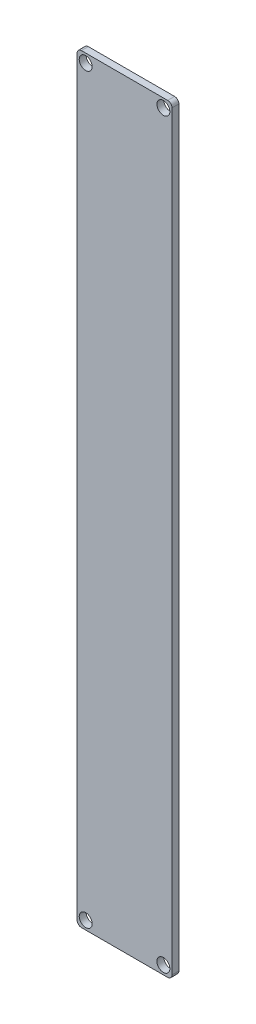
ISO-10303-21;
HEADER;
FILE_DESCRIPTION(('STEP AP214'),'2;1');
FILE_NAME('part.step','',(''),(''),'','','');
FILE_SCHEMA(('AUTOMOTIVE_DESIGN { 1 0 10303 214 1 1 1 1 }'));
ENDSEC;
DATA;
#1=APPLICATION_CONTEXT('core data for automotive mechanical design processes');
#2=APPLICATION_PROTOCOL_DEFINITION('international standard','automotive_design',2000,#1);
#3=PRODUCT_CONTEXT('',#1,'mechanical');
#4=PRODUCT('Part','Part','',(#3));
#5=PRODUCT_RELATED_PRODUCT_CATEGORY('part','',(#4));
#6=PRODUCT_DEFINITION_FORMATION('','',#4);
#7=PRODUCT_DEFINITION_CONTEXT('part definition',#1,'design');
#8=PRODUCT_DEFINITION('design','',#6,#7);
#9=PRODUCT_DEFINITION_SHAPE('','',#8);
#10=(LENGTH_UNIT() NAMED_UNIT(*) SI_UNIT(.MILLI.,.METRE.));
#11=(NAMED_UNIT(*) PLANE_ANGLE_UNIT() SI_UNIT($,.RADIAN.));
#12=(NAMED_UNIT(*) SI_UNIT($,.STERADIAN.) SOLID_ANGLE_UNIT());
#13=UNCERTAINTY_MEASURE_WITH_UNIT(LENGTH_MEASURE(1.E-05),#10,'distance_accuracy_value','');
#14=(GEOMETRIC_REPRESENTATION_CONTEXT(3) GLOBAL_UNCERTAINTY_ASSIGNED_CONTEXT((#13)) GLOBAL_UNIT_ASSIGNED_CONTEXT((#10,
#11,#12)) REPRESENTATION_CONTEXT('',''));
#15=CARTESIAN_POINT('',(0.,0.,0.));
#16=DIRECTION('',(0.,0.,1.));
#17=DIRECTION('',(1.,0.,0.));
#18=AXIS2_PLACEMENT_3D('',#15,#16,#17);
#19=CARTESIAN_POINT('',(-35.5384615384615,79.3692307692308,1.6));
#20=DIRECTION('',(1.,0.,0.));
#21=DIRECTION('',(0.,1.,0.));
#22=AXIS2_PLACEMENT_3D('',#19,#20,#21);
#23=PLANE('',#22);
#24=DIRECTION('',(0.,-1.,0.));
#25=VECTOR('',#24,1.);
#26=CARTESIAN_POINT('',(-35.5384615384615,79.3692307692308,1.6));
#27=LINE('',#26,#25);
#28=CARTESIAN_POINT('',(-35.5384615384615,78.3692307692308,1.6));
#29=VERTEX_POINT('',#28);
#30=CARTESIAN_POINT('',(-35.5384615384615,-95.6307692307692,1.6));
#31=VERTEX_POINT('',#30);
#32=EDGE_CURVE('E119',#29,#31,#27,.T.);
#33=ORIENTED_EDGE('',*,*,#32,.F.);
#34=DIRECTION('',(0.,0.,-1.));
#35=VECTOR('',#34,1.);
#36=CARTESIAN_POINT('',(-35.5384615384615,78.3692307692308,1.6));
#37=LINE('',#36,#35);
#38=CARTESIAN_POINT('',(-35.5384615384615,78.3692307692308,0.));
#39=VERTEX_POINT('',#38);
#40=EDGE_CURVE('E104',#29,#39,#37,.T.);
#41=ORIENTED_EDGE('',*,*,#40,.T.);
#42=DIRECTION('',(0.,-1.,0.));
#43=VECTOR('',#42,1.);
#44=CARTESIAN_POINT('',(-35.5384615384615,79.3692307692308,0.));
#45=LINE('',#44,#43);
#46=CARTESIAN_POINT('',(-35.5384615384615,-95.6307692307692,0.));
#47=VERTEX_POINT('',#46);
#48=EDGE_CURVE('E116',#39,#47,#45,.T.);
#49=ORIENTED_EDGE('',*,*,#48,.T.);
#50=DIRECTION('',(0.,0.,-1.));
#51=VECTOR('',#50,1.);
#52=CARTESIAN_POINT('',(-35.5384615384615,-95.6307692307692,1.6));
#53=LINE('',#52,#51);
#54=EDGE_CURVE('E121',#47,#31,#53,.F.);
#55=ORIENTED_EDGE('',*,*,#54,.T.);
#56=EDGE_LOOP('',(#33,#41,#49,#55));
#57=FACE_BOUND('',#56,.T.);
#58=ADVANCED_FACE('F34',(#57),#23,.F.);
#59=CARTESIAN_POINT('',(-35.5384615384615,-96.6307692307692,1.6));
#60=DIRECTION('',(0.,1.,0.));
#61=DIRECTION('',(0.,0.,1.));
#62=AXIS2_PLACEMENT_3D('',#59,#60,#61);
#63=PLANE('',#62);
#64=DIRECTION('',(1.,0.,0.));
#65=VECTOR('',#64,1.);
#66=CARTESIAN_POINT('',(-35.5384615384615,-96.6307692307692,0.));
#67=LINE('',#66,#65);
#68=CARTESIAN_POINT('',(-34.5384615384615,-96.6307692307692,0.));
#69=VERTEX_POINT('',#68);
#70=CARTESIAN_POINT('',(-14.5384615384615,-96.6307692307692,0.));
#71=VERTEX_POINT('',#70);
#72=EDGE_CURVE('E125',#69,#71,#67,.T.);
#73=ORIENTED_EDGE('',*,*,#72,.T.);
#74=DIRECTION('',(0.,0.,-1.));
#75=VECTOR('',#74,1.);
#76=CARTESIAN_POINT('',(-14.5384615384615,-96.6307692307692,1.6));
#77=LINE('',#76,#75);
#78=CARTESIAN_POINT('',(-14.5384615384615,-96.6307692307692,1.6));
#79=VERTEX_POINT('',#78);
#80=EDGE_CURVE('E11',#71,#79,#77,.F.);
#81=ORIENTED_EDGE('',*,*,#80,.T.);
#82=DIRECTION('',(1.,0.,0.));
#83=VECTOR('',#82,1.);
#84=CARTESIAN_POINT('',(-35.5384615384615,-96.6307692307692,1.6));
#85=LINE('',#84,#83);
#86=CARTESIAN_POINT('',(-34.5384615384615,-96.6307692307692,1.6));
#87=VERTEX_POINT('',#86);
#88=EDGE_CURVE('E165',#87,#79,#85,.T.);
#89=ORIENTED_EDGE('',*,*,#88,.F.);
#90=DIRECTION('',(0.,0.,-1.));
#91=VECTOR('',#90,1.);
#92=CARTESIAN_POINT('',(-34.5384615384615,-96.6307692307692,1.6));
#93=LINE('',#92,#91);
#94=EDGE_CURVE('E42',#87,#69,#93,.T.);
#95=ORIENTED_EDGE('',*,*,#94,.T.);
#96=EDGE_LOOP('',(#73,#81,#89,#95));
#97=FACE_BOUND('',#96,.T.);
#98=ADVANCED_FACE('F163',(#97),#63,.F.);
#99=CARTESIAN_POINT('',(-13.5384615384615,79.3692307692308,1.6));
#100=DIRECTION('',(-1.,0.,0.));
#101=DIRECTION('',(0.,-1.,0.));
#102=AXIS2_PLACEMENT_3D('',#99,#100,#101);
#103=PLANE('',#102);
#104=DIRECTION('',(0.,1.,0.));
#105=VECTOR('',#104,1.);
#106=CARTESIAN_POINT('',(-13.5384615384615,79.3692307692308,0.));
#107=LINE('',#106,#105);
#108=CARTESIAN_POINT('',(-13.5384615384615,-95.6307692307692,0.));
#109=VERTEX_POINT('',#108);
#110=CARTESIAN_POINT('',(-13.5384615384615,78.3692307692308,0.));
#111=VERTEX_POINT('',#110);
#112=EDGE_CURVE('E129',#109,#111,#107,.T.);
#113=ORIENTED_EDGE('',*,*,#112,.T.);
#114=DIRECTION('',(0.,0.,-1.));
#115=VECTOR('',#114,1.);
#116=CARTESIAN_POINT('',(-13.5384615384615,78.3692307692308,1.6));
#117=LINE('',#116,#115);
#118=CARTESIAN_POINT('',(-13.5384615384615,78.3692307692308,1.6));
#119=VERTEX_POINT('',#118);
#120=EDGE_CURVE('E49',#111,#119,#117,.F.);
#121=ORIENTED_EDGE('',*,*,#120,.T.);
#122=DIRECTION('',(0.,1.,0.));
#123=VECTOR('',#122,1.);
#124=CARTESIAN_POINT('',(-13.5384615384615,79.3692307692308,1.6));
#125=LINE('',#124,#123);
#126=CARTESIAN_POINT('',(-13.5384615384615,-95.6307692307692,1.6));
#127=VERTEX_POINT('',#126);
#128=EDGE_CURVE('E173',#127,#119,#125,.T.);
#129=ORIENTED_EDGE('',*,*,#128,.F.);
#130=DIRECTION('',(0.,0.,-1.));
#131=VECTOR('',#130,1.);
#132=CARTESIAN_POINT('',(-13.5384615384615,-95.6307692307692,1.6));
#133=LINE('',#132,#131);
#134=EDGE_CURVE('E156',#127,#109,#133,.T.);
#135=ORIENTED_EDGE('',*,*,#134,.T.);
#136=EDGE_LOOP('',(#113,#121,#129,#135));
#137=FACE_BOUND('',#136,.T.);
#138=ADVANCED_FACE('F172',(#137),#103,.F.);
#139=CARTESIAN_POINT('',(-35.5384615384615,79.3692307692308,1.6));
#140=DIRECTION('',(0.,-1.,0.));
#141=DIRECTION('',(0.,0.,-1.));
#142=AXIS2_PLACEMENT_3D('',#139,#140,#141);
#143=PLANE('',#142);
#144=DIRECTION('',(-1.,0.,0.));
#145=VECTOR('',#144,1.);
#146=CARTESIAN_POINT('',(-35.5384615384615,79.3692307692308,0.));
#147=LINE('',#146,#145);
#148=CARTESIAN_POINT('',(-14.5384615384615,79.3692307692308,0.));
#149=VERTEX_POINT('',#148);
#150=CARTESIAN_POINT('',(-34.5384615384615,79.3692307692308,0.));
#151=VERTEX_POINT('',#150);
#152=EDGE_CURVE('E139',#149,#151,#147,.T.);
#153=ORIENTED_EDGE('',*,*,#152,.T.);
#154=DIRECTION('',(0.,0.,-1.));
#155=VECTOR('',#154,1.);
#156=CARTESIAN_POINT('',(-34.5384615384615,79.3692307692308,1.6));
#157=LINE('',#156,#155);
#158=CARTESIAN_POINT('',(-34.5384615384615,79.3692307692308,1.6));
#159=VERTEX_POINT('',#158);
#160=EDGE_CURVE('E105',#151,#159,#157,.F.);
#161=ORIENTED_EDGE('',*,*,#160,.T.);
#162=DIRECTION('',(-1.,0.,0.));
#163=VECTOR('',#162,1.);
#164=CARTESIAN_POINT('',(-35.5384615384615,79.3692307692308,1.6));
#165=LINE('',#164,#163);
#166=CARTESIAN_POINT('',(-14.5384615384615,79.3692307692308,1.6));
#167=VERTEX_POINT('',#166);
#168=EDGE_CURVE('E135',#167,#159,#165,.T.);
#169=ORIENTED_EDGE('',*,*,#168,.F.);
#170=DIRECTION('',(0.,0.,-1.));
#171=VECTOR('',#170,1.);
#172=CARTESIAN_POINT('',(-14.5384615384615,79.3692307692308,1.6));
#173=LINE('',#172,#171);
#174=EDGE_CURVE('E110',#167,#149,#173,.T.);
#175=ORIENTED_EDGE('',*,*,#174,.T.);
#176=EDGE_LOOP('',(#153,#161,#169,#175));
#177=FACE_BOUND('',#176,.T.);
#178=ADVANCED_FACE('F213',(#177),#143,.F.);
#179=CARTESIAN_POINT('',(0.,0.,1.6));
#180=DIRECTION('',(0.,0.,1.));
#181=DIRECTION('',(1.,0.,0.));
#182=AXIS2_PLACEMENT_3D('',#179,#180,#181);
#183=PLANE('',#182);
#184=CARTESIAN_POINT('',(-15.5384615384615,77.3692307692308,1.6));
#185=DIRECTION('',(0.,0.,1.));
#186=DIRECTION('',(1.,0.,0.));
#187=AXIS2_PLACEMENT_3D('',#184,#185,#186);
#188=CIRCLE('',#187,1.5);
#189=CARTESIAN_POINT('',(-14.0384615384615,77.3692307692308,1.6));
#190=VERTEX_POINT('',#189);
#191=EDGE_CURVE('E189',#190,#190,#188,.T.);
#192=ORIENTED_EDGE('',*,*,#191,.F.);
#193=EDGE_LOOP('',(#192));
#194=FACE_BOUND('',#193,.T.);
#195=CARTESIAN_POINT('',(-33.5384615384615,-94.6307692307692,1.6));
#196=DIRECTION('',(0.,0.,1.));
#197=DIRECTION('',(1.,0.,0.));
#198=AXIS2_PLACEMENT_3D('',#195,#196,#197);
#199=CIRCLE('',#198,1.5);
#200=CARTESIAN_POINT('',(-32.0384615384615,-94.6307692307692,1.6));
#201=VERTEX_POINT('',#200);
#202=EDGE_CURVE('E182',#201,#201,#199,.T.);
#203=ORIENTED_EDGE('',*,*,#202,.F.);
#204=EDGE_LOOP('',(#203));
#205=FACE_BOUND('',#204,.T.);
#206=CARTESIAN_POINT('',(-15.5384615384615,-94.6307692307692,1.6));
#207=DIRECTION('',(0.,0.,1.));
#208=DIRECTION('',(1.,0.,0.));
#209=AXIS2_PLACEMENT_3D('',#206,#207,#208);
#210=CIRCLE('',#209,1.5);
#211=CARTESIAN_POINT('',(-14.0384615384615,-94.6307692307692,1.6));
#212=VERTEX_POINT('',#211);
#213=EDGE_CURVE('E194',#212,#212,#210,.T.);
#214=ORIENTED_EDGE('',*,*,#213,.F.);
#215=EDGE_LOOP('',(#214));
#216=FACE_BOUND('',#215,.T.);
#217=CARTESIAN_POINT('',(-33.5384615384615,77.3692307692308,1.6));
#218=DIRECTION('',(0.,0.,1.));
#219=DIRECTION('',(1.,0.,0.));
#220=AXIS2_PLACEMENT_3D('',#217,#218,#219);
#221=CIRCLE('',#220,1.5);
#222=CARTESIAN_POINT('',(-32.0384615384615,77.3692307692308,1.6));
#223=VERTEX_POINT('',#222);
#224=EDGE_CURVE('E132',#223,#223,#221,.T.);
#225=ORIENTED_EDGE('',*,*,#224,.F.);
#226=EDGE_LOOP('',(#225));
#227=FACE_BOUND('',#226,.T.);
#228=ORIENTED_EDGE('',*,*,#168,.T.);
#229=CARTESIAN_POINT('',(-34.5384615384615,78.3692307692308,1.6));
#230=DIRECTION('',(0.,0.,1.));
#231=DIRECTION('',(1.,0.,0.));
#232=AXIS2_PLACEMENT_3D('',#229,#230,#231);
#233=CIRCLE('',#232,1.);
#234=EDGE_CURVE('E154',#159,#29,#233,.T.);
#235=ORIENTED_EDGE('',*,*,#234,.T.);
#236=ORIENTED_EDGE('',*,*,#32,.T.);
#237=CARTESIAN_POINT('',(-34.5384615384615,-95.6307692307692,1.6));
#238=DIRECTION('',(0.,0.,1.));
#239=DIRECTION('',(1.,0.,0.));
#240=AXIS2_PLACEMENT_3D('',#237,#238,#239);
#241=CIRCLE('',#240,1.);
#242=EDGE_CURVE('E149',#31,#87,#241,.T.);
#243=ORIENTED_EDGE('',*,*,#242,.T.);
#244=ORIENTED_EDGE('',*,*,#88,.T.);
#245=CARTESIAN_POINT('',(-14.5384615384615,-95.6307692307692,1.6));
#246=DIRECTION('',(0.,0.,1.));
#247=DIRECTION('',(1.,0.,0.));
#248=AXIS2_PLACEMENT_3D('',#245,#246,#247);
#249=CIRCLE('',#248,1.);
#250=EDGE_CURVE('E56',#79,#127,#249,.T.);
#251=ORIENTED_EDGE('',*,*,#250,.T.);
#252=ORIENTED_EDGE('',*,*,#128,.T.);
#253=CARTESIAN_POINT('',(-14.5384615384615,78.3692307692308,1.6));
#254=DIRECTION('',(0.,0.,1.));
#255=DIRECTION('',(1.,0.,0.));
#256=AXIS2_PLACEMENT_3D('',#253,#254,#255);
#257=CIRCLE('',#256,1.);
#258=EDGE_CURVE('E152',#119,#167,#257,.T.);
#259=ORIENTED_EDGE('',*,*,#258,.T.);
#260=EDGE_LOOP('',(#228,#235,#236,#243,#244,#251,#252,#259));
#261=FACE_BOUND('',#260,.T.);
#262=ADVANCED_FACE('F210',(#194,#205,#216,#227,#261),#183,.T.);
#263=CARTESIAN_POINT('',(0.,0.,0.));
#264=DIRECTION('',(0.,0.,1.));
#265=DIRECTION('',(1.,0.,0.));
#266=AXIS2_PLACEMENT_3D('',#263,#264,#265);
#267=PLANE('',#266);
#268=CARTESIAN_POINT('',(-15.5384615384615,77.3692307692308,0.));
#269=DIRECTION('',(0.,0.,1.));
#270=DIRECTION('',(1.,0.,0.));
#271=AXIS2_PLACEMENT_3D('',#268,#269,#270);
#272=CIRCLE('',#271,1.5);
#273=CARTESIAN_POINT('',(-14.0384615384615,77.3692307692308,0.));
#274=VERTEX_POINT('',#273);
#275=EDGE_CURVE('E180',#274,#274,#272,.T.);
#276=ORIENTED_EDGE('',*,*,#275,.T.);
#277=EDGE_LOOP('',(#276));
#278=FACE_BOUND('',#277,.T.);
#279=CARTESIAN_POINT('',(-33.5384615384615,-94.6307692307692,0.));
#280=DIRECTION('',(0.,0.,1.));
#281=DIRECTION('',(1.,0.,0.));
#282=AXIS2_PLACEMENT_3D('',#279,#280,#281);
#283=CIRCLE('',#282,1.5);
#284=CARTESIAN_POINT('',(-32.0384615384615,-94.6307692307692,0.));
#285=VERTEX_POINT('',#284);
#286=EDGE_CURVE('E185',#285,#285,#283,.T.);
#287=ORIENTED_EDGE('',*,*,#286,.T.);
#288=EDGE_LOOP('',(#287));
#289=FACE_BOUND('',#288,.T.);
#290=CARTESIAN_POINT('',(-15.5384615384615,-94.6307692307692,0.));
#291=DIRECTION('',(0.,0.,1.));
#292=DIRECTION('',(1.,0.,0.));
#293=AXIS2_PLACEMENT_3D('',#290,#291,#292);
#294=CIRCLE('',#293,1.5);
#295=CARTESIAN_POINT('',(-14.0384615384615,-94.6307692307692,0.));
#296=VERTEX_POINT('',#295);
#297=EDGE_CURVE('E186',#296,#296,#294,.T.);
#298=ORIENTED_EDGE('',*,*,#297,.T.);
#299=EDGE_LOOP('',(#298));
#300=FACE_BOUND('',#299,.T.);
#301=CARTESIAN_POINT('',(-33.5384615384615,77.3692307692308,0.));
#302=DIRECTION('',(0.,0.,1.));
#303=DIRECTION('',(1.,0.,0.));
#304=AXIS2_PLACEMENT_3D('',#301,#302,#303);
#305=CIRCLE('',#304,1.5);
#306=CARTESIAN_POINT('',(-32.0384615384615,77.3692307692308,0.));
#307=VERTEX_POINT('',#306);
#308=EDGE_CURVE('E126',#307,#307,#305,.T.);
#309=ORIENTED_EDGE('',*,*,#308,.T.);
#310=EDGE_LOOP('',(#309));
#311=FACE_BOUND('',#310,.T.);
#312=ORIENTED_EDGE('',*,*,#48,.F.);
#313=CARTESIAN_POINT('',(-34.5384615384615,78.3692307692308,0.));
#314=DIRECTION('',(0.,0.,1.));
#315=DIRECTION('',(1.,0.,0.));
#316=AXIS2_PLACEMENT_3D('',#313,#314,#315);
#317=CIRCLE('',#316,1.);
#318=EDGE_CURVE('E100',#39,#151,#317,.F.);
#319=ORIENTED_EDGE('',*,*,#318,.T.);
#320=ORIENTED_EDGE('',*,*,#152,.F.);
#321=CARTESIAN_POINT('',(-14.5384615384615,78.3692307692308,0.));
#322=DIRECTION('',(0.,0.,1.));
#323=DIRECTION('',(1.,0.,0.));
#324=AXIS2_PLACEMENT_3D('',#321,#322,#323);
#325=CIRCLE('',#324,1.);
#326=EDGE_CURVE('E111',#149,#111,#325,.F.);
#327=ORIENTED_EDGE('',*,*,#326,.T.);
#328=ORIENTED_EDGE('',*,*,#112,.F.);
#329=CARTESIAN_POINT('',(-14.5384615384615,-95.6307692307692,0.));
#330=DIRECTION('',(0.,0.,1.));
#331=DIRECTION('',(1.,0.,0.));
#332=AXIS2_PLACEMENT_3D('',#329,#330,#331);
#333=CIRCLE('',#332,1.);
#334=EDGE_CURVE('E143',#109,#71,#333,.F.);
#335=ORIENTED_EDGE('',*,*,#334,.T.);
#336=ORIENTED_EDGE('',*,*,#72,.F.);
#337=CARTESIAN_POINT('',(-34.5384615384615,-95.6307692307692,0.));
#338=DIRECTION('',(0.,0.,1.));
#339=DIRECTION('',(1.,0.,0.));
#340=AXIS2_PLACEMENT_3D('',#337,#338,#339);
#341=CIRCLE('',#340,1.);
#342=EDGE_CURVE('E120',#69,#47,#341,.F.);
#343=ORIENTED_EDGE('',*,*,#342,.T.);
#344=EDGE_LOOP('',(#312,#319,#320,#327,#328,#335,#336,#343));
#345=FACE_BOUND('',#344,.T.);
#346=ADVANCED_FACE('F123',(#278,#289,#300,#311,#345),#267,.F.);
#347=CARTESIAN_POINT('',(-33.5384615384615,77.3692307692308,0.));
#348=DIRECTION('',(0.,0.,1.));
#349=DIRECTION('',(1.,0.,0.));
#350=AXIS2_PLACEMENT_3D('',#347,#348,#349);
#351=CYLINDRICAL_SURFACE('',#350,1.5);
#352=ORIENTED_EDGE('',*,*,#308,.F.);
#353=EDGE_LOOP('',(#352));
#354=FACE_BOUND('',#353,.T.);
#355=ORIENTED_EDGE('',*,*,#224,.T.);
#356=EDGE_LOOP('',(#355));
#357=FACE_BOUND('',#356,.T.);
#358=ADVANCED_FACE('F206',(#354,#357),#351,.F.);
#359=CARTESIAN_POINT('',(-15.5384615384615,-94.6307692307692,0.));
#360=DIRECTION('',(0.,0.,1.));
#361=DIRECTION('',(1.,0.,0.));
#362=AXIS2_PLACEMENT_3D('',#359,#360,#361);
#363=CYLINDRICAL_SURFACE('',#362,1.5);
#364=ORIENTED_EDGE('',*,*,#297,.F.);
#365=EDGE_LOOP('',(#364));
#366=FACE_BOUND('',#365,.T.);
#367=ORIENTED_EDGE('',*,*,#213,.T.);
#368=EDGE_LOOP('',(#367));
#369=FACE_BOUND('',#368,.T.);
#370=ADVANCED_FACE('F202',(#366,#369),#363,.F.);
#371=CARTESIAN_POINT('',(-33.5384615384615,-94.6307692307692,0.));
#372=DIRECTION('',(0.,0.,1.));
#373=DIRECTION('',(1.,0.,0.));
#374=AXIS2_PLACEMENT_3D('',#371,#372,#373);
#375=CYLINDRICAL_SURFACE('',#374,1.5);
#376=ORIENTED_EDGE('',*,*,#286,.F.);
#377=EDGE_LOOP('',(#376));
#378=FACE_BOUND('',#377,.T.);
#379=ORIENTED_EDGE('',*,*,#202,.T.);
#380=EDGE_LOOP('',(#379));
#381=FACE_BOUND('',#380,.T.);
#382=ADVANCED_FACE('F205',(#378,#381),#375,.F.);
#383=CARTESIAN_POINT('',(-15.5384615384615,77.3692307692308,0.));
#384=DIRECTION('',(0.,0.,1.));
#385=DIRECTION('',(1.,0.,0.));
#386=AXIS2_PLACEMENT_3D('',#383,#384,#385);
#387=CYLINDRICAL_SURFACE('',#386,1.5);
#388=ORIENTED_EDGE('',*,*,#275,.F.);
#389=EDGE_LOOP('',(#388));
#390=FACE_BOUND('',#389,.T.);
#391=ORIENTED_EDGE('',*,*,#191,.T.);
#392=EDGE_LOOP('',(#391));
#393=FACE_BOUND('',#392,.T.);
#394=ADVANCED_FACE('F228',(#390,#393),#387,.F.);
#395=CARTESIAN_POINT('',(-34.5384615384615,78.3692307692308,1.6));
#396=DIRECTION('',(0.,0.,-1.));
#397=DIRECTION('',(-1.,0.,0.));
#398=AXIS2_PLACEMENT_3D('',#395,#396,#397);
#399=CYLINDRICAL_SURFACE('',#398,1.);
#400=ORIENTED_EDGE('',*,*,#234,.F.);
#401=ORIENTED_EDGE('',*,*,#160,.F.);
#402=ORIENTED_EDGE('',*,*,#318,.F.);
#403=ORIENTED_EDGE('',*,*,#40,.F.);
#404=EDGE_LOOP('',(#400,#401,#402,#403));
#405=FACE_BOUND('',#404,.T.);
#406=ADVANCED_FACE('F103',(#405),#399,.T.);
#407=CARTESIAN_POINT('',(-14.5384615384615,78.3692307692308,1.6));
#408=DIRECTION('',(0.,0.,-1.));
#409=DIRECTION('',(-1.,0.,0.));
#410=AXIS2_PLACEMENT_3D('',#407,#408,#409);
#411=CYLINDRICAL_SURFACE('',#410,1.);
#412=ORIENTED_EDGE('',*,*,#258,.F.);
#413=ORIENTED_EDGE('',*,*,#120,.F.);
#414=ORIENTED_EDGE('',*,*,#326,.F.);
#415=ORIENTED_EDGE('',*,*,#174,.F.);
#416=EDGE_LOOP('',(#412,#413,#414,#415));
#417=FACE_BOUND('',#416,.T.);
#418=ADVANCED_FACE('F221',(#417),#411,.T.);
#419=CARTESIAN_POINT('',(-14.5384615384615,-95.6307692307692,1.6));
#420=DIRECTION('',(0.,0.,-1.));
#421=DIRECTION('',(-1.,0.,0.));
#422=AXIS2_PLACEMENT_3D('',#419,#420,#421);
#423=CYLINDRICAL_SURFACE('',#422,1.);
#424=ORIENTED_EDGE('',*,*,#250,.F.);
#425=ORIENTED_EDGE('',*,*,#80,.F.);
#426=ORIENTED_EDGE('',*,*,#334,.F.);
#427=ORIENTED_EDGE('',*,*,#134,.F.);
#428=EDGE_LOOP('',(#424,#425,#426,#427));
#429=FACE_BOUND('',#428,.T.);
#430=ADVANCED_FACE('F171',(#429),#423,.T.);
#431=CARTESIAN_POINT('',(-34.5384615384615,-95.6307692307692,1.6));
#432=DIRECTION('',(0.,0.,-1.));
#433=DIRECTION('',(-1.,0.,0.));
#434=AXIS2_PLACEMENT_3D('',#431,#432,#433);
#435=CYLINDRICAL_SURFACE('',#434,1.);
#436=ORIENTED_EDGE('',*,*,#242,.F.);
#437=ORIENTED_EDGE('',*,*,#54,.F.);
#438=ORIENTED_EDGE('',*,*,#342,.F.);
#439=ORIENTED_EDGE('',*,*,#94,.F.);
#440=EDGE_LOOP('',(#436,#437,#438,#439));
#441=FACE_BOUND('',#440,.T.);
#442=ADVANCED_FACE('F36',(#441),#435,.T.);
#443=CLOSED_SHELL('',(#58,#98,#138,#178,#262,#346,#358,#370,#382,#394,#406,#418,#430,#442));
#444=MANIFOLD_SOLID_BREP('B2',#443);
#445=ADVANCED_BREP_SHAPE_REPRESENTATION('',(#18,#444),#14);
#446=SHAPE_DEFINITION_REPRESENTATION(#9,#445);
ENDSEC;
END-ISO-10303-21;
